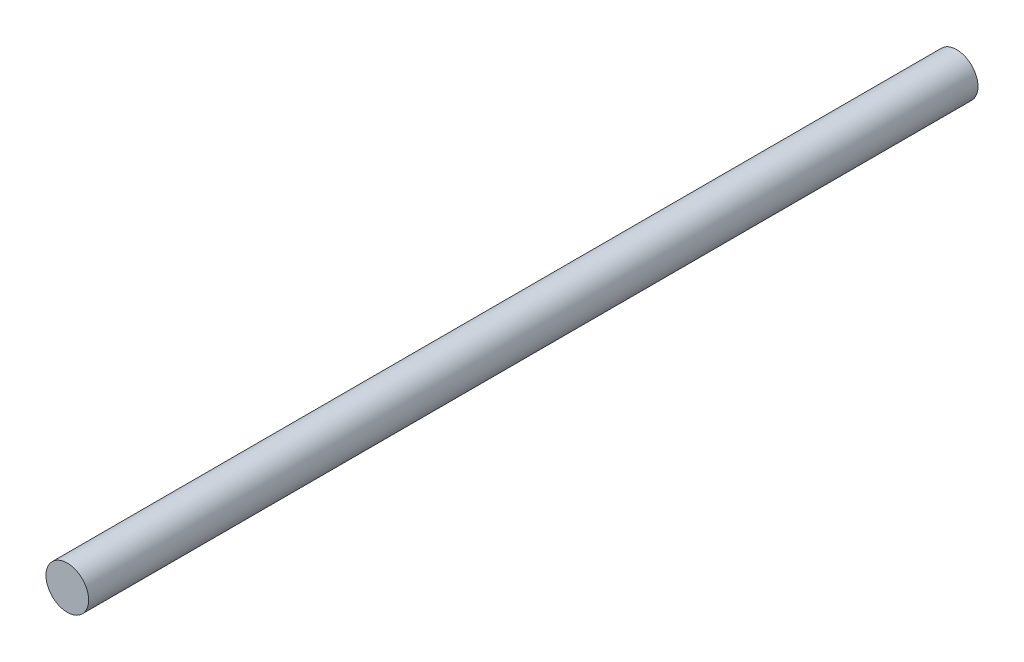
ISO-10303-21;
HEADER;
FILE_DESCRIPTION(('STEP AP214'),'2;1');
FILE_NAME('part.step','',(''),(''),'','','');
FILE_SCHEMA(('AUTOMOTIVE_DESIGN { 1 0 10303 214 1 1 1 1 }'));
ENDSEC;
DATA;
#1=APPLICATION_CONTEXT('core data for automotive mechanical design processes');
#2=APPLICATION_PROTOCOL_DEFINITION('international standard','automotive_design',2000,#1);
#3=PRODUCT_CONTEXT('',#1,'mechanical');
#4=PRODUCT('Part','Part','',(#3));
#5=PRODUCT_RELATED_PRODUCT_CATEGORY('part','',(#4));
#6=PRODUCT_DEFINITION_FORMATION('','',#4);
#7=PRODUCT_DEFINITION_CONTEXT('part definition',#1,'design');
#8=PRODUCT_DEFINITION('design','',#6,#7);
#9=PRODUCT_DEFINITION_SHAPE('','',#8);
#10=(LENGTH_UNIT() NAMED_UNIT(*) SI_UNIT(.MILLI.,.METRE.));
#11=(NAMED_UNIT(*) PLANE_ANGLE_UNIT() SI_UNIT($,.RADIAN.));
#12=(NAMED_UNIT(*) SI_UNIT($,.STERADIAN.) SOLID_ANGLE_UNIT());
#13=UNCERTAINTY_MEASURE_WITH_UNIT(LENGTH_MEASURE(1.E-05),#10,'distance_accuracy_value','');
#14=(GEOMETRIC_REPRESENTATION_CONTEXT(3) GLOBAL_UNCERTAINTY_ASSIGNED_CONTEXT((#13)) GLOBAL_UNIT_ASSIGNED_CONTEXT((#10,
#11,#12)) REPRESENTATION_CONTEXT('',''));
#15=CARTESIAN_POINT('',(0.,0.,0.));
#16=DIRECTION('',(0.,0.,1.));
#17=DIRECTION('',(1.,0.,0.));
#18=AXIS2_PLACEMENT_3D('',#15,#16,#17);
#19=CARTESIAN_POINT('',(0.,0.,125.));
#20=DIRECTION('',(0.,0.,-1.));
#21=DIRECTION('',(-1.,0.,0.));
#22=AXIS2_PLACEMENT_3D('',#19,#20,#21);
#23=CYLINDRICAL_SURFACE('',#22,3.);
#24=CARTESIAN_POINT('',(0.,0.,125.));
#25=DIRECTION('',(0.,0.,1.));
#26=DIRECTION('',(1.,0.,0.));
#27=AXIS2_PLACEMENT_3D('',#24,#25,#26);
#28=CIRCLE('',#27,3.);
#29=CARTESIAN_POINT('',(3.,0.,125.));
#30=VERTEX_POINT('',#29);
#31=EDGE_CURVE('E10',#30,#30,#28,.T.);
#32=ORIENTED_EDGE('',*,*,#31,.F.);
#33=EDGE_LOOP('',(#32));
#34=FACE_BOUND('',#33,.T.);
#35=CARTESIAN_POINT('',(0.,0.,0.));
#36=DIRECTION('',(0.,0.,1.));
#37=DIRECTION('',(1.,0.,0.));
#38=AXIS2_PLACEMENT_3D('',#35,#36,#37);
#39=CIRCLE('',#38,3.);
#40=CARTESIAN_POINT('',(3.,0.,0.));
#41=VERTEX_POINT('',#40);
#42=EDGE_CURVE('E42',#41,#41,#39,.T.);
#43=ORIENTED_EDGE('',*,*,#42,.T.);
#44=EDGE_LOOP('',(#43));
#45=FACE_BOUND('',#44,.T.);
#46=ADVANCED_FACE('F39',(#34,#45),#23,.T.);
#47=CARTESIAN_POINT('',(0.,0.,125.));
#48=DIRECTION('',(0.,0.,1.));
#49=DIRECTION('',(1.,0.,0.));
#50=AXIS2_PLACEMENT_3D('',#47,#48,#49);
#51=PLANE('',#50);
#52=ORIENTED_EDGE('',*,*,#31,.T.);
#53=EDGE_LOOP('',(#52));
#54=FACE_BOUND('',#53,.T.);
#55=ADVANCED_FACE('F54',(#54),#51,.T.);
#56=CARTESIAN_POINT('',(0.,0.,0.));
#57=DIRECTION('',(0.,0.,1.));
#58=DIRECTION('',(1.,0.,0.));
#59=AXIS2_PLACEMENT_3D('',#56,#57,#58);
#60=PLANE('',#59);
#61=ORIENTED_EDGE('',*,*,#42,.F.);
#62=EDGE_LOOP('',(#61));
#63=FACE_BOUND('',#62,.T.);
#64=ADVANCED_FACE('F52',(#63),#60,.F.);
#65=CLOSED_SHELL('',(#46,#55,#64));
#66=MANIFOLD_SOLID_BREP('B2',#65);
#67=ADVANCED_BREP_SHAPE_REPRESENTATION('',(#18,#66),#14);
#68=SHAPE_DEFINITION_REPRESENTATION(#9,#67);
ENDSEC;
END-ISO-10303-21;
